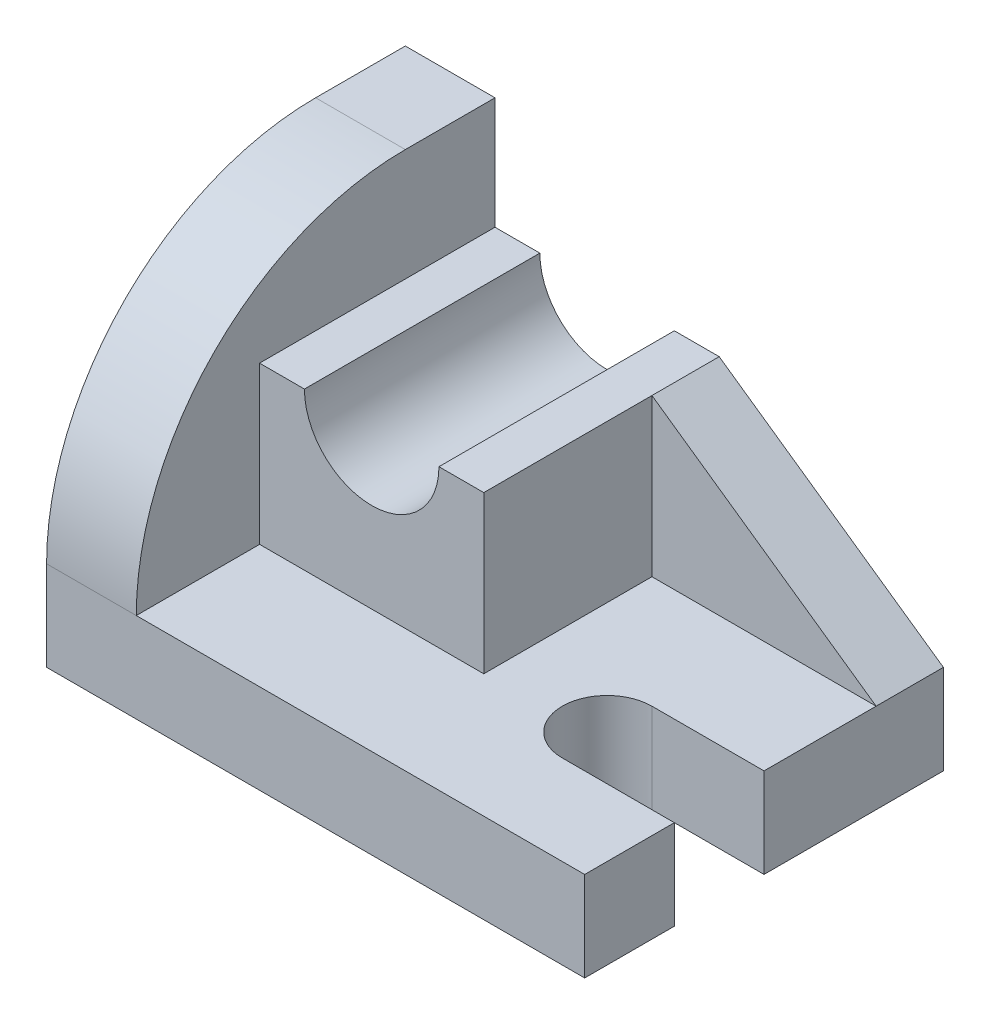
ISO-10303-21;
HEADER;
FILE_DESCRIPTION(('STEP AP214'),'2;1');
FILE_NAME('part.step','',(''),(''),'','','');
FILE_SCHEMA(('AUTOMOTIVE_DESIGN { 1 0 10303 214 1 1 1 1 }'));
ENDSEC;
DATA;
#1=APPLICATION_CONTEXT('core data for automotive mechanical design processes');
#2=APPLICATION_PROTOCOL_DEFINITION('international standard','automotive_design',2000,#1);
#3=PRODUCT_CONTEXT('',#1,'mechanical');
#4=PRODUCT('Part','Part','',(#3));
#5=PRODUCT_RELATED_PRODUCT_CATEGORY('part','',(#4));
#6=PRODUCT_DEFINITION_FORMATION('','',#4);
#7=PRODUCT_DEFINITION_CONTEXT('part definition',#1,'design');
#8=PRODUCT_DEFINITION('design','',#6,#7);
#9=PRODUCT_DEFINITION_SHAPE('','',#8);
#10=(LENGTH_UNIT() NAMED_UNIT(*) SI_UNIT(.MILLI.,.METRE.));
#11=(NAMED_UNIT(*) PLANE_ANGLE_UNIT() SI_UNIT($,.RADIAN.));
#12=(NAMED_UNIT(*) SI_UNIT($,.STERADIAN.) SOLID_ANGLE_UNIT());
#13=UNCERTAINTY_MEASURE_WITH_UNIT(LENGTH_MEASURE(1.E-05),#10,'distance_accuracy_value','');
#14=(GEOMETRIC_REPRESENTATION_CONTEXT(3) GLOBAL_UNCERTAINTY_ASSIGNED_CONTEXT((#13)) GLOBAL_UNIT_ASSIGNED_CONTEXT((#10,
#11,#12)) REPRESENTATION_CONTEXT('',''));
#15=CARTESIAN_POINT('',(0.,0.,0.));
#16=DIRECTION('',(0.,0.,1.));
#17=DIRECTION('',(1.,0.,0.));
#18=AXIS2_PLACEMENT_3D('',#15,#16,#17);
#19=CARTESIAN_POINT('',(48.,16.,-32.));
#20=DIRECTION('',(-1.,0.,0.));
#21=DIRECTION('',(0.,0.,1.));
#22=AXIS2_PLACEMENT_3D('',#19,#20,#21);
#23=PLANE('',#22);
#24=DIRECTION('',(0.,0.,-1.));
#25=VECTOR('',#24,1.);
#26=CARTESIAN_POINT('',(48.,16.,-32.));
#27=LINE('',#26,#25);
#28=CARTESIAN_POINT('',(48.,16.,0.));
#29=VERTEX_POINT('',#28);
#30=CARTESIAN_POINT('',(48.,16.,-20.));
#31=VERTEX_POINT('',#30);
#32=EDGE_CURVE('E242',#29,#31,#27,.T.);
#33=ORIENTED_EDGE('',*,*,#32,.F.);
#34=DIRECTION('',(0.,1.,0.));
#35=VECTOR('',#34,1.);
#36=CARTESIAN_POINT('',(48.,0.,0.));
#37=LINE('',#36,#35);
#38=CARTESIAN_POINT('',(48.,0.,0.));
#39=VERTEX_POINT('',#38);
#40=EDGE_CURVE('E181',#39,#29,#37,.T.);
#41=ORIENTED_EDGE('',*,*,#40,.F.);
#42=DIRECTION('',(0.,0.,-1.));
#43=VECTOR('',#42,1.);
#44=CARTESIAN_POINT('',(48.,0.,-32.));
#45=LINE('',#44,#43);
#46=CARTESIAN_POINT('',(48.,0.,-32.));
#47=VERTEX_POINT('',#46);
#48=EDGE_CURVE('E237',#39,#47,#45,.T.);
#49=ORIENTED_EDGE('',*,*,#48,.T.);
#50=DIRECTION('',(0.,-1.,0.));
#51=VECTOR('',#50,1.);
#52=CARTESIAN_POINT('',(48.,16.,-32.));
#53=LINE('',#52,#51);
#54=CARTESIAN_POINT('',(48.,16.,-32.));
#55=VERTEX_POINT('',#54);
#56=EDGE_CURVE('E261',#55,#47,#53,.T.);
#57=ORIENTED_EDGE('',*,*,#56,.F.);
#58=DIRECTION('',(0.,0.,-1.));
#59=VECTOR('',#58,1.);
#60=CARTESIAN_POINT('',(48.,16.,-20.));
#61=LINE('',#60,#59);
#62=EDGE_CURVE('E193',#31,#55,#61,.T.);
#63=ORIENTED_EDGE('',*,*,#62,.F.);
#64=EDGE_LOOP('',(#33,#41,#49,#57,#63));
#65=FACE_BOUND('',#64,.T.);
#66=ADVANCED_FACE('F34',(#65),#23,.F.);
#67=CARTESIAN_POINT('',(0.,16.,0.));
#68=DIRECTION('',(0.,1.,0.));
#69=DIRECTION('',(0.,0.,1.));
#70=AXIS2_PLACEMENT_3D('',#67,#68,#69);
#71=PLANE('',#70);
#72=DIRECTION('',(-1.,0.,0.));
#73=VECTOR('',#72,1.);
#74=CARTESIAN_POINT('',(28.,16.,0.));
#75=LINE('',#74,#73);
#76=CARTESIAN_POINT('',(28.,16.,0.));
#77=VERTEX_POINT('',#76);
#78=EDGE_CURVE('E169',#29,#77,#75,.T.);
#79=ORIENTED_EDGE('',*,*,#78,.F.);
#80=ORIENTED_EDGE('',*,*,#32,.T.);
#81=DIRECTION('',(-1.,0.,0.));
#82=VECTOR('',#81,1.);
#83=CARTESIAN_POINT('',(48.,16.,-20.));
#84=LINE('',#83,#82);
#85=CARTESIAN_POINT('',(8.00000000000002,16.,-20.));
#86=VERTEX_POINT('',#85);
#87=EDGE_CURVE('E184',#31,#86,#84,.T.);
#88=ORIENTED_EDGE('',*,*,#87,.T.);
#89=DIRECTION('',(0.,0.,1.));
#90=VECTOR('',#89,1.);
#91=CARTESIAN_POINT('',(8.00000000000002,16.,-32.));
#92=LINE('',#91,#90);
#93=CARTESIAN_POINT('',(8.00000000000003,16.,10.));
#94=VERTEX_POINT('',#93);
#95=EDGE_CURVE('E217',#86,#94,#92,.T.);
#96=ORIENTED_EDGE('',*,*,#95,.T.);
#97=DIRECTION('',(1.,0.,0.));
#98=VECTOR('',#97,1.);
#99=CARTESIAN_POINT('',(-32.,16.,10.));
#100=LINE('',#99,#98);
#101=CARTESIAN_POINT('',(-32.,16.,10.));
#102=VERTEX_POINT('',#101);
#103=EDGE_CURVE('E199',#102,#94,#100,.T.);
#104=ORIENTED_EDGE('',*,*,#103,.F.);
#105=DIRECTION('',(0.,0.,1.));
#106=VECTOR('',#105,1.);
#107=CARTESIAN_POINT('',(-32.,16.,-32.));
#108=LINE('',#107,#106);
#109=CARTESIAN_POINT('',(-32.,16.,32.));
#110=VERTEX_POINT('',#109);
#111=EDGE_CURVE('E223',#102,#110,#108,.T.);
#112=ORIENTED_EDGE('',*,*,#111,.T.);
#113=DIRECTION('',(1.,0.,0.));
#114=VECTOR('',#113,1.);
#115=CARTESIAN_POINT('',(-48.,16.,32.));
#116=LINE('',#115,#114);
#117=CARTESIAN_POINT('',(48.,16.,32.));
#118=VERTEX_POINT('',#117);
#119=EDGE_CURVE('E241',#110,#118,#116,.T.);
#120=ORIENTED_EDGE('',*,*,#119,.T.);
#121=CARTESIAN_POINT('',(48.,16.,16.));
#122=VERTEX_POINT('',#121);
#123=EDGE_CURVE('E238',#118,#122,#27,.T.);
#124=ORIENTED_EDGE('',*,*,#123,.T.);
#125=DIRECTION('',(1.,0.,0.));
#126=VECTOR('',#125,1.);
#127=CARTESIAN_POINT('',(28.,16.,16.));
#128=LINE('',#127,#126);
#129=CARTESIAN_POINT('',(28.,16.,16.));
#130=VERTEX_POINT('',#129);
#131=EDGE_CURVE('E172',#130,#122,#128,.T.);
#132=ORIENTED_EDGE('',*,*,#131,.F.);
#133=CARTESIAN_POINT('',(28.,16.,8.00000000000001));
#134=DIRECTION('',(0.,1.,0.));
#135=DIRECTION('',(0.,0.,1.));
#136=AXIS2_PLACEMENT_3D('',#133,#134,#135);
#137=CIRCLE('',#136,8.);
#138=EDGE_CURVE('E157',#77,#130,#137,.T.);
#139=ORIENTED_EDGE('',*,*,#138,.F.);
#140=EDGE_LOOP('',(#79,#80,#88,#96,#104,#112,#120,#124,#132,#139));
#141=FACE_BOUND('',#140,.T.);
#142=ADVANCED_FACE('F303',(#141),#71,.T.);
#143=CARTESIAN_POINT('',(8.00000000000002,44.,-32.));
#144=DIRECTION('',(1.,0.,0.));
#145=DIRECTION('',(0.,0.,-1.));
#146=AXIS2_PLACEMENT_3D('',#143,#144,#145);
#147=PLANE('',#146);
#148=ORIENTED_EDGE('',*,*,#95,.F.);
#149=DIRECTION('',(0.,1.,0.));
#150=VECTOR('',#149,1.);
#151=CARTESIAN_POINT('',(8.00000000000002,16.,-20.));
#152=LINE('',#151,#150);
#153=CARTESIAN_POINT('',(8.00000000000002,44.,-20.));
#154=VERTEX_POINT('',#153);
#155=EDGE_CURVE('E187',#86,#154,#152,.T.);
#156=ORIENTED_EDGE('',*,*,#155,.T.);
#157=DIRECTION('',(0.,0.,1.));
#158=VECTOR('',#157,1.);
#159=CARTESIAN_POINT('',(8.00000000000002,44.,-32.));
#160=LINE('',#159,#158);
#161=CARTESIAN_POINT('',(8.00000000000003,44.,10.));
#162=VERTEX_POINT('',#161);
#163=EDGE_CURVE('E204',#154,#162,#160,.T.);
#164=ORIENTED_EDGE('',*,*,#163,.T.);
#165=DIRECTION('',(0.,-1.,0.));
#166=VECTOR('',#165,1.);
#167=CARTESIAN_POINT('',(8.00000000000003,44.,10.));
#168=LINE('',#167,#166);
#169=EDGE_CURVE('E220',#162,#94,#168,.T.);
#170=ORIENTED_EDGE('',*,*,#169,.T.);
#171=EDGE_LOOP('',(#148,#156,#164,#170));
#172=FACE_BOUND('',#171,.T.);
#173=ADVANCED_FACE('F340',(#172),#147,.T.);
#174=CARTESIAN_POINT('',(0.,44.,0.));
#175=DIRECTION('',(0.,-1.,0.));
#176=DIRECTION('',(0.,0.,-1.));
#177=AXIS2_PLACEMENT_3D('',#174,#175,#176);
#178=PLANE('',#177);
#179=DIRECTION('',(1.,0.,0.));
#180=VECTOR('',#179,1.);
#181=CARTESIAN_POINT('',(-32.,44.,-32.));
#182=LINE('',#181,#180);
#183=CARTESIAN_POINT('',(0.,44.,-32.));
#184=VERTEX_POINT('',#183);
#185=CARTESIAN_POINT('',(8.00000000000002,44.,-32.));
#186=VERTEX_POINT('',#185);
#187=EDGE_CURVE('E208',#184,#186,#182,.T.);
#188=ORIENTED_EDGE('',*,*,#187,.F.);
#189=DIRECTION('',(0.,0.,1.));
#190=VECTOR('',#189,1.);
#191=CARTESIAN_POINT('',(0.,44.,-32.));
#192=LINE('',#191,#190);
#193=CARTESIAN_POINT('',(0.,44.,10.));
#194=VERTEX_POINT('',#193);
#195=EDGE_CURVE('E11',#184,#194,#192,.T.);
#196=ORIENTED_EDGE('',*,*,#195,.T.);
#197=DIRECTION('',(1.,0.,0.));
#198=VECTOR('',#197,1.);
#199=CARTESIAN_POINT('',(-32.,44.,10.));
#200=LINE('',#199,#198);
#201=EDGE_CURVE('E205',#194,#162,#200,.T.);
#202=ORIENTED_EDGE('',*,*,#201,.T.);
#203=ORIENTED_EDGE('',*,*,#163,.F.);
#204=EDGE_CURVE('E206',#186,#154,#160,.T.);
#205=ORIENTED_EDGE('',*,*,#204,.F.);
#206=EDGE_LOOP('',(#188,#196,#202,#203,#205));
#207=FACE_BOUND('',#206,.T.);
#208=ADVANCED_FACE('F313',(#207),#178,.F.);
#209=CARTESIAN_POINT('',(-32.,64.,-32.));
#210=DIRECTION('',(1.,0.,0.));
#211=DIRECTION('',(0.,0.,-1.));
#212=AXIS2_PLACEMENT_3D('',#209,#210,#211);
#213=PLANE('',#212);
#214=ORIENTED_EDGE('',*,*,#111,.F.);
#215=DIRECTION('',(0.,-1.,0.));
#216=VECTOR('',#215,1.);
#217=CARTESIAN_POINT('',(-32.,44.,10.));
#218=LINE('',#217,#216);
#219=CARTESIAN_POINT('',(-32.,44.,10.));
#220=VERTEX_POINT('',#219);
#221=EDGE_CURVE('E214',#220,#102,#218,.T.);
#222=ORIENTED_EDGE('',*,*,#221,.F.);
#223=DIRECTION('',(0.,0.,1.));
#224=VECTOR('',#223,1.);
#225=CARTESIAN_POINT('',(-32.,44.,-32.));
#226=LINE('',#225,#224);
#227=CARTESIAN_POINT('',(-32.,44.,-32.));
#228=VERTEX_POINT('',#227);
#229=EDGE_CURVE('E212',#228,#220,#226,.T.);
#230=ORIENTED_EDGE('',*,*,#229,.F.);
#231=DIRECTION('',(0.,-1.,0.));
#232=VECTOR('',#231,1.);
#233=CARTESIAN_POINT('',(-32.,64.,-32.));
#234=LINE('',#233,#232);
#235=CARTESIAN_POINT('',(-32.,64.,-32.));
#236=VERTEX_POINT('',#235);
#237=EDGE_CURVE('E233',#236,#228,#234,.T.);
#238=ORIENTED_EDGE('',*,*,#237,.F.);
#239=DIRECTION('',(0.,0.,1.));
#240=VECTOR('',#239,1.);
#241=CARTESIAN_POINT('',(-32.,64.,-32.));
#242=LINE('',#241,#240);
#243=CARTESIAN_POINT('',(-32.,64.,-16.));
#244=VERTEX_POINT('',#243);
#245=EDGE_CURVE('E224',#236,#244,#242,.T.);
#246=ORIENTED_EDGE('',*,*,#245,.T.);
#247=CARTESIAN_POINT('',(-32.,16.,-16.));
#248=DIRECTION('',(1.,0.,0.));
#249=DIRECTION('',(0.,0.,-1.));
#250=AXIS2_PLACEMENT_3D('',#247,#248,#249);
#251=CIRCLE('',#250,48.);
#252=EDGE_CURVE('E267',#244,#110,#251,.T.);
#253=ORIENTED_EDGE('',*,*,#252,.T.);
#254=EDGE_LOOP('',(#214,#222,#230,#238,#246,#253));
#255=FACE_BOUND('',#254,.T.);
#256=ADVANCED_FACE('F286',(#255),#213,.T.);
#257=CARTESIAN_POINT('',(48.,0.,32.));
#258=VERTEX_POINT('',#257);
#259=CARTESIAN_POINT('',(48.,0.,16.));
#260=VERTEX_POINT('',#259);
#261=EDGE_CURVE('E245',#258,#260,#45,.T.);
#262=ORIENTED_EDGE('',*,*,#261,.T.);
#263=DIRECTION('',(0.,1.,0.));
#264=VECTOR('',#263,1.);
#265=CARTESIAN_POINT('',(48.,0.,16.));
#266=LINE('',#265,#264);
#267=EDGE_CURVE('E49',#260,#122,#266,.T.);
#268=ORIENTED_EDGE('',*,*,#267,.T.);
#269=ORIENTED_EDGE('',*,*,#123,.F.);
#270=DIRECTION('',(0.,-1.,0.));
#271=VECTOR('',#270,1.);
#272=CARTESIAN_POINT('',(48.,16.,32.));
#273=LINE('',#272,#271);
#274=EDGE_CURVE('E244',#118,#258,#273,.T.);
#275=ORIENTED_EDGE('',*,*,#274,.T.);
#276=EDGE_LOOP('',(#262,#268,#269,#275));
#277=FACE_BOUND('',#276,.T.);
#278=ADVANCED_FACE('F328',(#277),#23,.F.);
#279=CARTESIAN_POINT('',(-48.,16.,-32.));
#280=DIRECTION('',(0.,0.,1.));
#281=DIRECTION('',(1.,0.,0.));
#282=AXIS2_PLACEMENT_3D('',#279,#280,#281);
#283=PLANE('',#282);
#284=CARTESIAN_POINT('',(-24.,44.,-32.));
#285=VERTEX_POINT('',#284);
#286=EDGE_CURVE('E209',#228,#285,#182,.T.);
#287=ORIENTED_EDGE('',*,*,#286,.T.);
#288=CARTESIAN_POINT('',(-12.,44.,-32.));
#289=DIRECTION('',(0.,0.,1.));
#290=DIRECTION('',(1.,0.,0.));
#291=AXIS2_PLACEMENT_3D('',#288,#289,#290);
#292=CIRCLE('',#291,12.);
#293=EDGE_CURVE('E57',#285,#184,#292,.T.);
#294=ORIENTED_EDGE('',*,*,#293,.T.);
#295=ORIENTED_EDGE('',*,*,#187,.T.);
#296=DIRECTION('',(0.819231920519041,-0.573462344363328,0.));
#297=VECTOR('',#296,1.);
#298=CARTESIAN_POINT('',(8.00000000000002,44.,-32.));
#299=LINE('',#298,#297);
#300=EDGE_CURVE('E180',#186,#55,#299,.T.);
#301=ORIENTED_EDGE('',*,*,#300,.T.);
#302=ORIENTED_EDGE('',*,*,#56,.T.);
#303=DIRECTION('',(-1.,0.,0.));
#304=VECTOR('',#303,1.);
#305=CARTESIAN_POINT('',(-48.,0.,-32.));
#306=LINE('',#305,#304);
#307=CARTESIAN_POINT('',(-48.,0.,-32.));
#308=VERTEX_POINT('',#307);
#309=EDGE_CURVE('E247',#47,#308,#306,.T.);
#310=ORIENTED_EDGE('',*,*,#309,.T.);
#311=DIRECTION('',(0.,-1.,0.));
#312=VECTOR('',#311,1.);
#313=CARTESIAN_POINT('',(-48.,16.,-32.));
#314=LINE('',#313,#312);
#315=CARTESIAN_POINT('',(-48.,64.,-32.));
#316=VERTEX_POINT('',#315);
#317=EDGE_CURVE('E258',#316,#308,#314,.T.);
#318=ORIENTED_EDGE('',*,*,#317,.F.);
#319=DIRECTION('',(1.,0.,0.));
#320=VECTOR('',#319,1.);
#321=CARTESIAN_POINT('',(-48.,64.,-32.));
#322=LINE('',#321,#320);
#323=EDGE_CURVE('E227',#316,#236,#322,.T.);
#324=ORIENTED_EDGE('',*,*,#323,.T.);
#325=ORIENTED_EDGE('',*,*,#237,.T.);
#326=EDGE_LOOP('',(#287,#294,#295,#301,#302,#310,#318,#324,#325));
#327=FACE_BOUND('',#326,.T.);
#328=ADVANCED_FACE('F279',(#327),#283,.F.);
#329=CARTESIAN_POINT('',(-48.,16.,-32.));
#330=DIRECTION('',(1.,0.,0.));
#331=DIRECTION('',(0.,0.,-1.));
#332=AXIS2_PLACEMENT_3D('',#329,#330,#331);
#333=PLANE('',#332);
#334=DIRECTION('',(0.,-1.,0.));
#335=VECTOR('',#334,1.);
#336=CARTESIAN_POINT('',(-48.,16.,32.));
#337=LINE('',#336,#335);
#338=CARTESIAN_POINT('',(-48.,16.,32.));
#339=VERTEX_POINT('',#338);
#340=CARTESIAN_POINT('',(-48.,0.,32.));
#341=VERTEX_POINT('',#340);
#342=EDGE_CURVE('E256',#339,#341,#337,.T.);
#343=ORIENTED_EDGE('',*,*,#342,.F.);
#344=CARTESIAN_POINT('',(-48.,16.,-16.));
#345=DIRECTION('',(1.,0.,0.));
#346=DIRECTION('',(0.,0.,-1.));
#347=AXIS2_PLACEMENT_3D('',#344,#345,#346);
#348=CIRCLE('',#347,48.);
#349=CARTESIAN_POINT('',(-48.,64.,-16.));
#350=VERTEX_POINT('',#349);
#351=EDGE_CURVE('E272',#339,#350,#348,.F.);
#352=ORIENTED_EDGE('',*,*,#351,.T.);
#353=DIRECTION('',(0.,0.,1.));
#354=VECTOR('',#353,1.);
#355=CARTESIAN_POINT('',(-48.,64.,-32.));
#356=LINE('',#355,#354);
#357=EDGE_CURVE('E230',#316,#350,#356,.T.);
#358=ORIENTED_EDGE('',*,*,#357,.F.);
#359=ORIENTED_EDGE('',*,*,#317,.T.);
#360=DIRECTION('',(0.,0.,1.));
#361=VECTOR('',#360,1.);
#362=CARTESIAN_POINT('',(-48.,0.,-32.));
#363=LINE('',#362,#361);
#364=EDGE_CURVE('E249',#308,#341,#363,.T.);
#365=ORIENTED_EDGE('',*,*,#364,.T.);
#366=EDGE_LOOP('',(#343,#352,#358,#359,#365));
#367=FACE_BOUND('',#366,.T.);
#368=ADVANCED_FACE('F326',(#367),#333,.F.);
#369=CARTESIAN_POINT('',(-48.,16.,32.));
#370=DIRECTION('',(0.,0.,-1.));
#371=DIRECTION('',(-1.,0.,0.));
#372=AXIS2_PLACEMENT_3D('',#369,#370,#371);
#373=PLANE('',#372);
#374=ORIENTED_EDGE('',*,*,#119,.F.);
#375=DIRECTION('',(1.,0.,0.));
#376=VECTOR('',#375,1.);
#377=CARTESIAN_POINT('',(-48.,16.,32.));
#378=LINE('',#377,#376);
#379=EDGE_CURVE('E270',#110,#339,#378,.F.);
#380=ORIENTED_EDGE('',*,*,#379,.T.);
#381=ORIENTED_EDGE('',*,*,#342,.T.);
#382=DIRECTION('',(1.,0.,0.));
#383=VECTOR('',#382,1.);
#384=CARTESIAN_POINT('',(-48.,0.,32.));
#385=LINE('',#384,#383);
#386=EDGE_CURVE('E252',#341,#258,#385,.T.);
#387=ORIENTED_EDGE('',*,*,#386,.T.);
#388=ORIENTED_EDGE('',*,*,#274,.F.);
#389=EDGE_LOOP('',(#374,#380,#381,#387,#388));
#390=FACE_BOUND('',#389,.T.);
#391=ADVANCED_FACE('F298',(#390),#373,.F.);
#392=CARTESIAN_POINT('',(0.,0.,0.));
#393=DIRECTION('',(0.,1.,0.));
#394=DIRECTION('',(0.,0.,1.));
#395=AXIS2_PLACEMENT_3D('',#392,#393,#394);
#396=PLANE('',#395);
#397=ORIENTED_EDGE('',*,*,#48,.F.);
#398=DIRECTION('',(-1.,0.,0.));
#399=VECTOR('',#398,1.);
#400=CARTESIAN_POINT('',(28.,0.,0.));
#401=LINE('',#400,#399);
#402=CARTESIAN_POINT('',(28.,0.,0.));
#403=VERTEX_POINT('',#402);
#404=EDGE_CURVE('E159',#39,#403,#401,.T.);
#405=ORIENTED_EDGE('',*,*,#404,.T.);
#406=CARTESIAN_POINT('',(28.,0.,8.00000000000001));
#407=DIRECTION('',(0.,1.,0.));
#408=DIRECTION('',(0.,0.,1.));
#409=AXIS2_PLACEMENT_3D('',#406,#407,#408);
#410=CIRCLE('',#409,8.);
#411=CARTESIAN_POINT('',(28.,0.,16.));
#412=VERTEX_POINT('',#411);
#413=EDGE_CURVE('E154',#403,#412,#410,.T.);
#414=ORIENTED_EDGE('',*,*,#413,.T.);
#415=DIRECTION('',(1.,0.,0.));
#416=VECTOR('',#415,1.);
#417=CARTESIAN_POINT('',(28.,0.,16.));
#418=LINE('',#417,#416);
#419=EDGE_CURVE('E161',#412,#260,#418,.T.);
#420=ORIENTED_EDGE('',*,*,#419,.T.);
#421=ORIENTED_EDGE('',*,*,#261,.F.);
#422=ORIENTED_EDGE('',*,*,#386,.F.);
#423=ORIENTED_EDGE('',*,*,#364,.F.);
#424=ORIENTED_EDGE('',*,*,#309,.F.);
#425=EDGE_LOOP('',(#397,#405,#414,#420,#421,#422,#423,#424));
#426=FACE_BOUND('',#425,.T.);
#427=ADVANCED_FACE('F168',(#426),#396,.F.);
#428=CARTESIAN_POINT('',(0.,64.,0.));
#429=DIRECTION('',(0.,-1.,0.));
#430=DIRECTION('',(0.,0.,-1.));
#431=AXIS2_PLACEMENT_3D('',#428,#429,#430);
#432=PLANE('',#431);
#433=ORIENTED_EDGE('',*,*,#357,.T.);
#434=DIRECTION('',(1.,0.,0.));
#435=VECTOR('',#434,1.);
#436=CARTESIAN_POINT('',(0.,64.,-16.));
#437=LINE('',#436,#435);
#438=EDGE_CURVE('E264',#350,#244,#437,.T.);
#439=ORIENTED_EDGE('',*,*,#438,.T.);
#440=ORIENTED_EDGE('',*,*,#245,.F.);
#441=ORIENTED_EDGE('',*,*,#323,.F.);
#442=EDGE_LOOP('',(#433,#439,#440,#441));
#443=FACE_BOUND('',#442,.T.);
#444=ADVANCED_FACE('F289',(#443),#432,.F.);
#445=CARTESIAN_POINT('',(0.,16.,-16.));
#446=DIRECTION('',(1.,0.,0.));
#447=DIRECTION('',(0.,0.,-1.));
#448=AXIS2_PLACEMENT_3D('',#445,#446,#447);
#449=CYLINDRICAL_SURFACE('',#448,48.);
#450=ORIENTED_EDGE('',*,*,#351,.F.);
#451=ORIENTED_EDGE('',*,*,#379,.F.);
#452=ORIENTED_EDGE('',*,*,#252,.F.);
#453=ORIENTED_EDGE('',*,*,#438,.F.);
#454=EDGE_LOOP('',(#450,#451,#452,#453));
#455=FACE_BOUND('',#454,.T.);
#456=ADVANCED_FACE('F36',(#455),#449,.T.);
#457=CARTESIAN_POINT('',(-32.,44.,10.));
#458=DIRECTION('',(0.,0.,-1.));
#459=DIRECTION('',(-1.,0.,0.));
#460=AXIS2_PLACEMENT_3D('',#457,#458,#459);
#461=PLANE('',#460);
#462=ORIENTED_EDGE('',*,*,#201,.F.);
#463=CARTESIAN_POINT('',(-12.,44.,10.));
#464=DIRECTION('',(0.,0.,1.));
#465=DIRECTION('',(1.,0.,0.));
#466=AXIS2_PLACEMENT_3D('',#463,#464,#465);
#467=CIRCLE('',#466,12.);
#468=CARTESIAN_POINT('',(-24.,44.,10.));
#469=VERTEX_POINT('',#468);
#470=EDGE_CURVE('E197',#469,#194,#467,.T.);
#471=ORIENTED_EDGE('',*,*,#470,.F.);
#472=EDGE_CURVE('E201',#220,#469,#200,.T.);
#473=ORIENTED_EDGE('',*,*,#472,.F.);
#474=ORIENTED_EDGE('',*,*,#221,.T.);
#475=ORIENTED_EDGE('',*,*,#103,.T.);
#476=ORIENTED_EDGE('',*,*,#169,.F.);
#477=EDGE_LOOP('',(#462,#471,#473,#474,#475,#476));
#478=FACE_BOUND('',#477,.T.);
#479=ADVANCED_FACE('F309',(#478),#461,.F.);
#480=ORIENTED_EDGE('',*,*,#472,.T.);
#481=DIRECTION('',(0.,0.,1.));
#482=VECTOR('',#481,1.);
#483=CARTESIAN_POINT('',(-24.,44.,-32.));
#484=LINE('',#483,#482);
#485=EDGE_CURVE('E42',#469,#285,#484,.F.);
#486=ORIENTED_EDGE('',*,*,#485,.T.);
#487=ORIENTED_EDGE('',*,*,#286,.F.);
#488=ORIENTED_EDGE('',*,*,#229,.T.);
#489=EDGE_LOOP('',(#480,#486,#487,#488));
#490=FACE_BOUND('',#489,.T.);
#491=ADVANCED_FACE('F274',(#490),#178,.F.);
#492=CARTESIAN_POINT('',(-12.,44.,-32.));
#493=DIRECTION('',(0.,0.,1.));
#494=DIRECTION('',(1.,0.,0.));
#495=AXIS2_PLACEMENT_3D('',#492,#493,#494);
#496=CYLINDRICAL_SURFACE('',#495,12.);
#497=ORIENTED_EDGE('',*,*,#293,.F.);
#498=ORIENTED_EDGE('',*,*,#485,.F.);
#499=ORIENTED_EDGE('',*,*,#470,.T.);
#500=ORIENTED_EDGE('',*,*,#195,.F.);
#501=EDGE_LOOP('',(#497,#498,#499,#500));
#502=FACE_BOUND('',#501,.T.);
#503=ADVANCED_FACE('F311',(#502),#496,.F.);
#504=CARTESIAN_POINT('',(8.00000000000002,44.,-20.));
#505=DIRECTION('',(0.573462344363328,0.81923192051904,0.));
#506=DIRECTION('',(-0.819231920519041,0.573462344363328,0.));
#507=AXIS2_PLACEMENT_3D('',#504,#505,#506);
#508=PLANE('',#507);
#509=ORIENTED_EDGE('',*,*,#300,.F.);
#510=ORIENTED_EDGE('',*,*,#204,.T.);
#511=DIRECTION('',(0.819231920519041,-0.573462344363328,0.));
#512=VECTOR('',#511,1.);
#513=CARTESIAN_POINT('',(8.00000000000002,44.,-20.));
#514=LINE('',#513,#512);
#515=EDGE_CURVE('E190',#154,#31,#514,.T.);
#516=ORIENTED_EDGE('',*,*,#515,.T.);
#517=ORIENTED_EDGE('',*,*,#62,.T.);
#518=EDGE_LOOP('',(#509,#510,#516,#517));
#519=FACE_BOUND('',#518,.T.);
#520=ADVANCED_FACE('F396',(#519),#508,.T.);
#521=CARTESIAN_POINT('',(0.,0.,-20.));
#522=DIRECTION('',(0.,0.,-1.));
#523=DIRECTION('',(-1.,0.,0.));
#524=AXIS2_PLACEMENT_3D('',#521,#522,#523);
#525=PLANE('',#524);
#526=ORIENTED_EDGE('',*,*,#87,.F.);
#527=ORIENTED_EDGE('',*,*,#515,.F.);
#528=ORIENTED_EDGE('',*,*,#155,.F.);
#529=EDGE_LOOP('',(#526,#527,#528));
#530=FACE_BOUND('',#529,.T.);
#531=ADVANCED_FACE('F404',(#530),#525,.F.);
#532=CARTESIAN_POINT('',(28.,0.,8.00000000000001));
#533=DIRECTION('',(0.,1.,0.));
#534=DIRECTION('',(0.,0.,1.));
#535=AXIS2_PLACEMENT_3D('',#532,#533,#534);
#536=CYLINDRICAL_SURFACE('',#535,8.);
#537=ORIENTED_EDGE('',*,*,#138,.T.);
#538=DIRECTION('',(0.,1.,0.));
#539=VECTOR('',#538,1.);
#540=CARTESIAN_POINT('',(28.,0.,16.));
#541=LINE('',#540,#539);
#542=EDGE_CURVE('E151',#412,#130,#541,.T.);
#543=ORIENTED_EDGE('',*,*,#542,.F.);
#544=ORIENTED_EDGE('',*,*,#413,.F.);
#545=DIRECTION('',(0.,1.,0.));
#546=VECTOR('',#545,1.);
#547=CARTESIAN_POINT('',(28.,0.,0.));
#548=LINE('',#547,#546);
#549=EDGE_CURVE('E178',#403,#77,#548,.T.);
#550=ORIENTED_EDGE('',*,*,#549,.T.);
#551=EDGE_LOOP('',(#537,#543,#544,#550));
#552=FACE_BOUND('',#551,.T.);
#553=ADVANCED_FACE('F152',(#552),#536,.F.);
#554=CARTESIAN_POINT('',(28.,0.,0.));
#555=DIRECTION('',(0.,0.,-1.));
#556=DIRECTION('',(-1.,0.,0.));
#557=AXIS2_PLACEMENT_3D('',#554,#555,#556);
#558=PLANE('',#557);
#559=ORIENTED_EDGE('',*,*,#78,.T.);
#560=ORIENTED_EDGE('',*,*,#549,.F.);
#561=ORIENTED_EDGE('',*,*,#404,.F.);
#562=ORIENTED_EDGE('',*,*,#40,.T.);
#563=EDGE_LOOP('',(#559,#560,#561,#562));
#564=FACE_BOUND('',#563,.T.);
#565=ADVANCED_FACE('F417',(#564),#558,.F.);
#566=CARTESIAN_POINT('',(28.,0.,16.));
#567=DIRECTION('',(0.,0.,1.));
#568=DIRECTION('',(1.,0.,0.));
#569=AXIS2_PLACEMENT_3D('',#566,#567,#568);
#570=PLANE('',#569);
#571=ORIENTED_EDGE('',*,*,#131,.T.);
#572=ORIENTED_EDGE('',*,*,#267,.F.);
#573=ORIENTED_EDGE('',*,*,#419,.F.);
#574=ORIENTED_EDGE('',*,*,#542,.T.);
#575=EDGE_LOOP('',(#571,#572,#573,#574));
#576=FACE_BOUND('',#575,.T.);
#577=ADVANCED_FACE('F162',(#576),#570,.F.);
#578=CLOSED_SHELL('',(#66,#142,#173,#208,#256,#278,#328,#368,#391,#427,#444,#456,#479,#491,#503,
#520,#531,#553,#565,#577));
#579=MANIFOLD_SOLID_BREP('B2',#578);
#580=ADVANCED_BREP_SHAPE_REPRESENTATION('',(#18,#579),#14);
#581=SHAPE_DEFINITION_REPRESENTATION(#9,#580);
ENDSEC;
END-ISO-10303-21;
